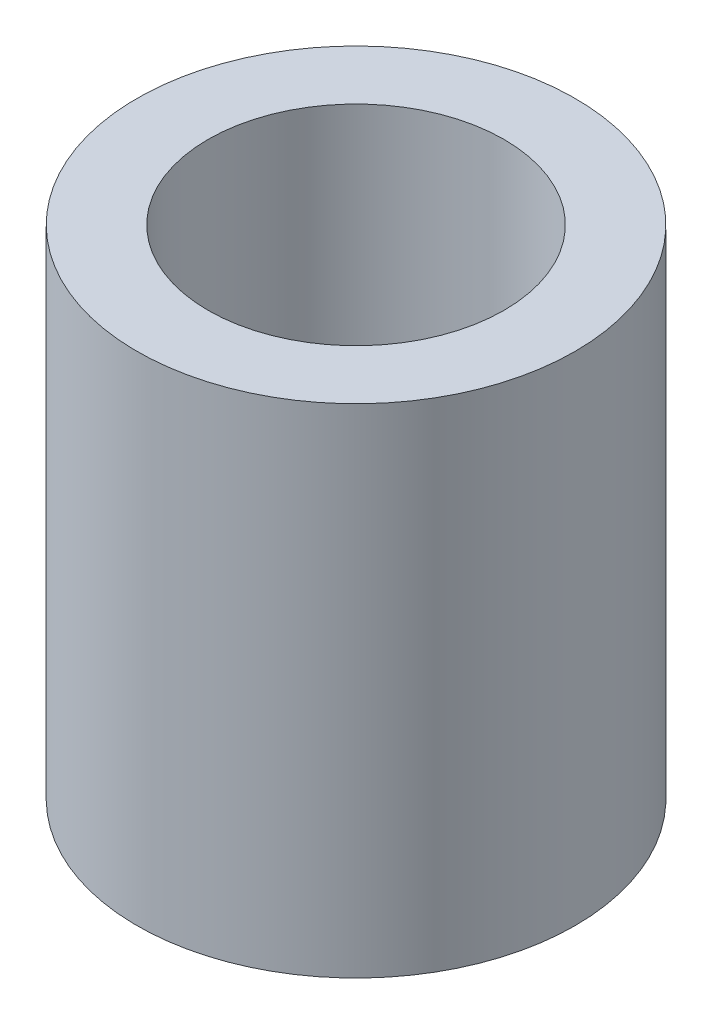
ISO-10303-21;
HEADER;
FILE_DESCRIPTION(('STEP AP214'),'2;1');
FILE_NAME('part.step','',(''),(''),'','','');
FILE_SCHEMA(('AUTOMOTIVE_DESIGN { 1 0 10303 214 1 1 1 1 }'));
ENDSEC;
DATA;
#1=APPLICATION_CONTEXT('core data for automotive mechanical design processes');
#2=APPLICATION_PROTOCOL_DEFINITION('international standard','automotive_design',2000,#1);
#3=PRODUCT_CONTEXT('',#1,'mechanical');
#4=PRODUCT('Part','Part','',(#3));
#5=PRODUCT_RELATED_PRODUCT_CATEGORY('part','',(#4));
#6=PRODUCT_DEFINITION_FORMATION('','',#4);
#7=PRODUCT_DEFINITION_CONTEXT('part definition',#1,'design');
#8=PRODUCT_DEFINITION('design','',#6,#7);
#9=PRODUCT_DEFINITION_SHAPE('','',#8);
#10=(LENGTH_UNIT() NAMED_UNIT(*) SI_UNIT(.MILLI.,.METRE.));
#11=(NAMED_UNIT(*) PLANE_ANGLE_UNIT() SI_UNIT($,.RADIAN.));
#12=(NAMED_UNIT(*) SI_UNIT($,.STERADIAN.) SOLID_ANGLE_UNIT());
#13=UNCERTAINTY_MEASURE_WITH_UNIT(LENGTH_MEASURE(1.E-05),#10,'distance_accuracy_value','');
#14=(GEOMETRIC_REPRESENTATION_CONTEXT(3) GLOBAL_UNCERTAINTY_ASSIGNED_CONTEXT((#13)) GLOBAL_UNIT_ASSIGNED_CONTEXT((#10,
#11,#12)) REPRESENTATION_CONTEXT('',''));
#15=CARTESIAN_POINT('',(0.,0.,0.));
#16=DIRECTION('',(0.,0.,1.));
#17=DIRECTION('',(1.,0.,0.));
#18=AXIS2_PLACEMENT_3D('',#15,#16,#17);
#19=CARTESIAN_POINT('',(0.,14.,0.));
#20=DIRECTION('',(0.,1.,0.));
#21=DIRECTION('',(-1.,0.,0.));
#22=AXIS2_PLACEMENT_3D('',#19,#20,#21);
#23=PLANE('',#22);
#24=CARTESIAN_POINT('',(0.,14.,0.));
#25=DIRECTION('',(0.,-1.,0.));
#26=DIRECTION('',(1.,0.,0.));
#27=AXIS2_PLACEMENT_3D('',#24,#25,#26);
#28=CIRCLE('',#27,12.4999999999999);
#29=CARTESIAN_POINT('',(12.4999999999999,14.0000000000001,0.));
#30=VERTEX_POINT('',#29);
#31=EDGE_CURVE('E10',#30,#30,#28,.T.);
#32=ORIENTED_EDGE('',*,*,#31,.F.);
#33=EDGE_LOOP('',(#32));
#34=FACE_BOUND('',#33,.T.);
#35=ADVANCED_FACE('F31',(#34),#23,.T.);
#36=CARTESIAN_POINT('',(3.28197791795103E-12,-939.995835417664,0.));
#37=DIRECTION('',(0.,-1.,0.));
#38=DIRECTION('',(1.,0.,0.));
#39=AXIS2_PLACEMENT_3D('',#36,#37,#38);
#40=CYLINDRICAL_SURFACE('',#39,12.4999999999999);
#41=ORIENTED_EDGE('',*,*,#31,.T.);
#42=EDGE_LOOP('',(#41));
#43=FACE_BOUND('',#42,.T.);
#44=CARTESIAN_POINT('',(-1.46642216231412E-13,42.,0.));
#45=DIRECTION('',(0.,-1.,0.));
#46=DIRECTION('',(1.,0.,0.));
#47=AXIS2_PLACEMENT_3D('',#44,#45,#46);
#48=CIRCLE('',#47,12.4999999999999);
#49=CARTESIAN_POINT('',(12.4999999999997,42.0000000000001,0.));
#50=VERTEX_POINT('',#49);
#51=EDGE_CURVE('E37',#50,#50,#48,.T.);
#52=ORIENTED_EDGE('',*,*,#51,.F.);
#53=EDGE_LOOP('',(#52));
#54=FACE_BOUND('',#53,.T.);
#55=ADVANCED_FACE('F63',(#43,#54),#40,.F.);
#56=CARTESIAN_POINT('',(0.,42.,0.));
#57=DIRECTION('',(0.,-1.,0.));
#58=DIRECTION('',(1.,0.,0.));
#59=AXIS2_PLACEMENT_3D('',#56,#57,#58);
#60=PLANE('',#59);
#61=CARTESIAN_POINT('',(-1.46642216231412E-13,42.0000000000001,0.));
#62=DIRECTION('',(0.,-1.,0.));
#63=DIRECTION('',(1.,0.,0.));
#64=AXIS2_PLACEMENT_3D('',#61,#62,#63);
#65=CIRCLE('',#64,18.4999999999999);
#66=CARTESIAN_POINT('',(18.4999999999997,42.0000000000002,0.));
#67=VERTEX_POINT('',#66);
#68=EDGE_CURVE('E41',#67,#67,#65,.T.);
#69=ORIENTED_EDGE('',*,*,#68,.F.);
#70=EDGE_LOOP('',(#69));
#71=FACE_BOUND('',#70,.T.);
#72=ORIENTED_EDGE('',*,*,#51,.T.);
#73=EDGE_LOOP('',(#72));
#74=FACE_BOUND('',#73,.T.);
#75=ADVANCED_FACE('F55',(#71,#74),#60,.F.);
#76=CARTESIAN_POINT('',(3.28197791795103E-12,-939.995835417664,0.));
#77=DIRECTION('',(0.,-1.,0.));
#78=DIRECTION('',(1.,0.,0.));
#79=AXIS2_PLACEMENT_3D('',#76,#77,#78);
#80=CYLINDRICAL_SURFACE('',#79,18.4999999999999);
#81=ORIENTED_EDGE('',*,*,#68,.T.);
#82=EDGE_LOOP('',(#81));
#83=FACE_BOUND('',#82,.T.);
#84=CARTESIAN_POINT('',(0.,1.11022302462516E-13,0.));
#85=DIRECTION('',(0.,-1.,0.));
#86=DIRECTION('',(1.,0.,0.));
#87=AXIS2_PLACEMENT_3D('',#84,#85,#86);
#88=CIRCLE('',#87,18.5);
#89=CARTESIAN_POINT('',(18.5,1.75614707231114E-13,0.));
#90=VERTEX_POINT('',#89);
#91=EDGE_CURVE('E45',#90,#90,#88,.T.);
#92=ORIENTED_EDGE('',*,*,#91,.F.);
#93=EDGE_LOOP('',(#92));
#94=FACE_BOUND('',#93,.T.);
#95=ADVANCED_FACE('F53',(#83,#94),#80,.T.);
#96=CARTESIAN_POINT('',(0.,0.,0.));
#97=DIRECTION('',(0.,-1.,0.));
#98=DIRECTION('',(1.,0.,0.));
#99=AXIS2_PLACEMENT_3D('',#96,#97,#98);
#100=PLANE('',#99);
#101=ORIENTED_EDGE('',*,*,#91,.T.);
#102=EDGE_LOOP('',(#101));
#103=FACE_BOUND('',#102,.T.);
#104=ADVANCED_FACE('F51',(#103),#100,.T.);
#105=CLOSED_SHELL('',(#35,#55,#75,#95,#104));
#106=MANIFOLD_SOLID_BREP('B2',#105);
#107=ADVANCED_BREP_SHAPE_REPRESENTATION('',(#18,#106),#14);
#108=SHAPE_DEFINITION_REPRESENTATION(#9,#107);
ENDSEC;
END-ISO-10303-21;
